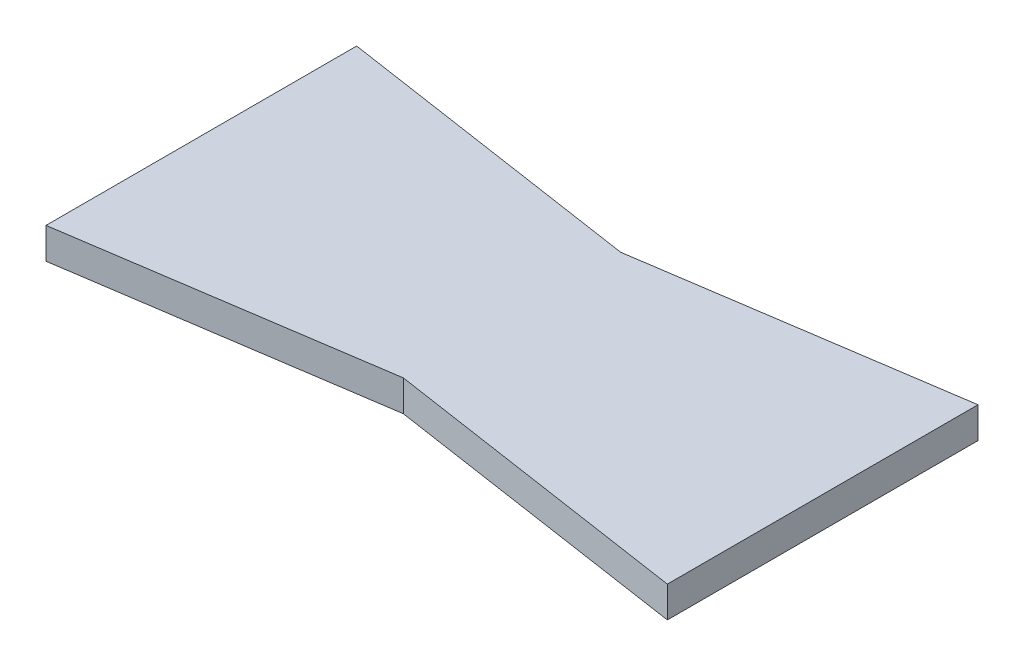
ISO-10303-21;
HEADER;
FILE_DESCRIPTION(('STEP AP214'),'2;1');
FILE_NAME('part.step','',(''),(''),'','','');
FILE_SCHEMA(('AUTOMOTIVE_DESIGN { 1 0 10303 214 1 1 1 1 }'));
ENDSEC;
DATA;
#1=APPLICATION_CONTEXT('core data for automotive mechanical design processes');
#2=APPLICATION_PROTOCOL_DEFINITION('international standard','automotive_design',2000,#1);
#3=PRODUCT_CONTEXT('',#1,'mechanical');
#4=PRODUCT('Part','Part','',(#3));
#5=PRODUCT_RELATED_PRODUCT_CATEGORY('part','',(#4));
#6=PRODUCT_DEFINITION_FORMATION('','',#4);
#7=PRODUCT_DEFINITION_CONTEXT('part definition',#1,'design');
#8=PRODUCT_DEFINITION('design','',#6,#7);
#9=PRODUCT_DEFINITION_SHAPE('','',#8);
#10=(LENGTH_UNIT() NAMED_UNIT(*) SI_UNIT(.MILLI.,.METRE.));
#11=(NAMED_UNIT(*) PLANE_ANGLE_UNIT() SI_UNIT($,.RADIAN.));
#12=(NAMED_UNIT(*) SI_UNIT($,.STERADIAN.) SOLID_ANGLE_UNIT());
#13=UNCERTAINTY_MEASURE_WITH_UNIT(LENGTH_MEASURE(1.E-05),#10,'distance_accuracy_value','');
#14=(GEOMETRIC_REPRESENTATION_CONTEXT(3) GLOBAL_UNCERTAINTY_ASSIGNED_CONTEXT((#13)) GLOBAL_UNIT_ASSIGNED_CONTEXT((#10,
#11,#12)) REPRESENTATION_CONTEXT('',''));
#15=CARTESIAN_POINT('',(0.,0.,0.));
#16=DIRECTION('',(0.,0.,1.));
#17=DIRECTION('',(1.,0.,0.));
#18=AXIS2_PLACEMENT_3D('',#15,#16,#17);
#19=CARTESIAN_POINT('',(-33.992673992674,4.,-22.1245421245421));
#20=DIRECTION('',(1.,0.,0.));
#21=DIRECTION('',(0.,0.,-1.));
#22=AXIS2_PLACEMENT_3D('',#19,#20,#21);
#23=PLANE('',#22);
#24=DIRECTION('',(0.,0.,1.));
#25=VECTOR('',#24,1.);
#26=CARTESIAN_POINT('',(-33.992673992674,0.,-22.1245421245421));
#27=LINE('',#26,#25);
#28=CARTESIAN_POINT('',(-33.992673992674,0.,-22.1245421245421));
#29=VERTEX_POINT('',#28);
#30=CARTESIAN_POINT('',(-33.992673992674,0.,17.8754578754579));
#31=VERTEX_POINT('',#30);
#32=EDGE_CURVE('E117',#29,#31,#27,.T.);
#33=ORIENTED_EDGE('',*,*,#32,.T.);
#34=DIRECTION('',(0.,-1.,0.));
#35=VECTOR('',#34,1.);
#36=CARTESIAN_POINT('',(-33.992673992674,4.,17.8754578754579));
#37=LINE('',#36,#35);
#38=CARTESIAN_POINT('',(-33.992673992674,4.,17.8754578754579));
#39=VERTEX_POINT('',#38);
#40=EDGE_CURVE('E11',#39,#31,#37,.T.);
#41=ORIENTED_EDGE('',*,*,#40,.F.);
#42=DIRECTION('',(0.,0.,1.));
#43=VECTOR('',#42,1.);
#44=CARTESIAN_POINT('',(-33.992673992674,4.,-22.1245421245421));
#45=LINE('',#44,#43);
#46=CARTESIAN_POINT('',(-33.992673992674,4.,-22.1245421245421));
#47=VERTEX_POINT('',#46);
#48=EDGE_CURVE('E127',#47,#39,#45,.T.);
#49=ORIENTED_EDGE('',*,*,#48,.F.);
#50=DIRECTION('',(0.,-1.,0.));
#51=VECTOR('',#50,1.);
#52=CARTESIAN_POINT('',(-33.992673992674,4.,-22.1245421245421));
#53=LINE('',#52,#51);
#54=EDGE_CURVE('E113',#47,#29,#53,.T.);
#55=ORIENTED_EDGE('',*,*,#54,.T.);
#56=EDGE_LOOP('',(#33,#41,#49,#55));
#57=FACE_BOUND('',#56,.T.);
#58=ADVANCED_FACE('F33',(#57),#23,.F.);
#59=CARTESIAN_POINT('',(-33.992673992674,4.,17.8754578754579));
#60=DIRECTION('',(-0.148340452930245,0.,-0.988936352868298));
#61=DIRECTION('',(-0.988936352868298,0.,0.148340452930245));
#62=AXIS2_PLACEMENT_3D('',#59,#60,#61);
#63=PLANE('',#62);
#64=DIRECTION('',(0.988936352868298,0.,-0.148340452930245));
#65=VECTOR('',#64,1.);
#66=CARTESIAN_POINT('',(-33.992673992674,0.,17.8754578754579));
#67=LINE('',#66,#65);
#68=CARTESIAN_POINT('',(6.00732600732602,0.,11.8754578754579));
#69=VERTEX_POINT('',#68);
#70=EDGE_CURVE('E120',#31,#69,#67,.T.);
#71=ORIENTED_EDGE('',*,*,#70,.T.);
#72=DIRECTION('',(0.,-1.,0.));
#73=VECTOR('',#72,1.);
#74=CARTESIAN_POINT('',(6.00732600732602,4.,11.8754578754579));
#75=LINE('',#74,#73);
#76=CARTESIAN_POINT('',(6.00732600732602,4.,11.8754578754579));
#77=VERTEX_POINT('',#76);
#78=EDGE_CURVE('E41',#77,#69,#75,.T.);
#79=ORIENTED_EDGE('',*,*,#78,.F.);
#80=DIRECTION('',(0.988936352868298,0.,-0.148340452930245));
#81=VECTOR('',#80,1.);
#82=CARTESIAN_POINT('',(-33.992673992674,4.,17.8754578754579));
#83=LINE('',#82,#81);
#84=EDGE_CURVE('E86',#39,#77,#83,.T.);
#85=ORIENTED_EDGE('',*,*,#84,.F.);
#86=ORIENTED_EDGE('',*,*,#40,.T.);
#87=EDGE_LOOP('',(#71,#79,#85,#86));
#88=FACE_BOUND('',#87,.T.);
#89=ADVANCED_FACE('F151',(#88),#63,.F.);
#90=CARTESIAN_POINT('',(6.00732600732602,4.,11.8754578754579));
#91=DIRECTION('',(0.148340452930245,0.,-0.988936352868298));
#92=DIRECTION('',(-0.988936352868298,0.,-0.148340452930245));
#93=AXIS2_PLACEMENT_3D('',#90,#91,#92);
#94=PLANE('',#93);
#95=DIRECTION('',(0.988936352868298,0.,0.148340452930245));
#96=VECTOR('',#95,1.);
#97=CARTESIAN_POINT('',(6.00732600732602,0.,11.8754578754579));
#98=LINE('',#97,#96);
#99=CARTESIAN_POINT('',(46.007326007326,0.,17.8754578754579));
#100=VERTEX_POINT('',#99);
#101=EDGE_CURVE('E122',#69,#100,#98,.T.);
#102=ORIENTED_EDGE('',*,*,#101,.T.);
#103=DIRECTION('',(0.,-1.,0.));
#104=VECTOR('',#103,1.);
#105=CARTESIAN_POINT('',(46.007326007326,4.,17.8754578754579));
#106=LINE('',#105,#104);
#107=CARTESIAN_POINT('',(46.007326007326,4.,17.8754578754579));
#108=VERTEX_POINT('',#107);
#109=EDGE_CURVE('E108',#108,#100,#106,.T.);
#110=ORIENTED_EDGE('',*,*,#109,.F.);
#111=DIRECTION('',(0.988936352868298,0.,0.148340452930245));
#112=VECTOR('',#111,1.);
#113=CARTESIAN_POINT('',(6.00732600732602,4.,11.8754578754579));
#114=LINE('',#113,#112);
#115=EDGE_CURVE('E99',#77,#108,#114,.T.);
#116=ORIENTED_EDGE('',*,*,#115,.F.);
#117=ORIENTED_EDGE('',*,*,#78,.T.);
#118=EDGE_LOOP('',(#102,#110,#116,#117));
#119=FACE_BOUND('',#118,.T.);
#120=ADVANCED_FACE('F133',(#119),#94,.F.);
#121=CARTESIAN_POINT('',(46.007326007326,4.,-22.1245421245421));
#122=DIRECTION('',(-1.,0.,0.));
#123=DIRECTION('',(0.,0.,1.));
#124=AXIS2_PLACEMENT_3D('',#121,#122,#123);
#125=PLANE('',#124);
#126=DIRECTION('',(0.,0.,-1.));
#127=VECTOR('',#126,1.);
#128=CARTESIAN_POINT('',(46.007326007326,0.,-22.1245421245421));
#129=LINE('',#128,#127);
#130=CARTESIAN_POINT('',(46.007326007326,0.,-22.1245421245421));
#131=VERTEX_POINT('',#130);
#132=EDGE_CURVE('E107',#100,#131,#129,.T.);
#133=ORIENTED_EDGE('',*,*,#132,.T.);
#134=DIRECTION('',(0.,-1.,0.));
#135=VECTOR('',#134,1.);
#136=CARTESIAN_POINT('',(46.007326007326,4.,-22.1245421245421));
#137=LINE('',#136,#135);
#138=CARTESIAN_POINT('',(46.007326007326,4.,-22.1245421245421));
#139=VERTEX_POINT('',#138);
#140=EDGE_CURVE('E104',#139,#131,#137,.T.);
#141=ORIENTED_EDGE('',*,*,#140,.F.);
#142=DIRECTION('',(0.,0.,-1.));
#143=VECTOR('',#142,1.);
#144=CARTESIAN_POINT('',(46.007326007326,4.,-22.1245421245421));
#145=LINE('',#144,#143);
#146=EDGE_CURVE('E93',#108,#139,#145,.T.);
#147=ORIENTED_EDGE('',*,*,#146,.F.);
#148=ORIENTED_EDGE('',*,*,#109,.T.);
#149=EDGE_LOOP('',(#133,#141,#147,#148));
#150=FACE_BOUND('',#149,.T.);
#151=ADVANCED_FACE('F105',(#150),#125,.F.);
#152=CARTESIAN_POINT('',(6.00732600732602,4.,-16.1245421245421));
#153=DIRECTION('',(0.148340452930245,0.,0.988936352868298));
#154=DIRECTION('',(0.988936352868298,0.,-0.148340452930245));
#155=AXIS2_PLACEMENT_3D('',#152,#153,#154);
#156=PLANE('',#155);
#157=DIRECTION('',(-0.988936352868298,0.,0.148340452930245));
#158=VECTOR('',#157,1.);
#159=CARTESIAN_POINT('',(6.00732600732602,0.,-16.1245421245421));
#160=LINE('',#159,#158);
#161=CARTESIAN_POINT('',(6.00732600732602,0.,-16.1245421245421));
#162=VERTEX_POINT('',#161);
#163=EDGE_CURVE('E72',#131,#162,#160,.T.);
#164=ORIENTED_EDGE('',*,*,#163,.T.);
#165=DIRECTION('',(0.,-1.,0.));
#166=VECTOR('',#165,1.);
#167=CARTESIAN_POINT('',(6.00732600732602,4.,-16.1245421245421));
#168=LINE('',#167,#166);
#169=CARTESIAN_POINT('',(6.00732600732602,4.,-16.1245421245421));
#170=VERTEX_POINT('',#169);
#171=EDGE_CURVE('E109',#170,#162,#168,.T.);
#172=ORIENTED_EDGE('',*,*,#171,.F.);
#173=DIRECTION('',(-0.988936352868298,0.,0.148340452930245));
#174=VECTOR('',#173,1.);
#175=CARTESIAN_POINT('',(6.00732600732602,4.,-16.1245421245421));
#176=LINE('',#175,#174);
#177=EDGE_CURVE('E97',#139,#170,#176,.T.);
#178=ORIENTED_EDGE('',*,*,#177,.F.);
#179=ORIENTED_EDGE('',*,*,#140,.T.);
#180=EDGE_LOOP('',(#164,#172,#178,#179));
#181=FACE_BOUND('',#180,.T.);
#182=ADVANCED_FACE('F111',(#181),#156,.F.);
#183=CARTESIAN_POINT('',(-33.992673992674,4.,-22.1245421245421));
#184=DIRECTION('',(-0.148340452930245,0.,0.988936352868298));
#185=DIRECTION('',(0.988936352868298,0.,0.148340452930245));
#186=AXIS2_PLACEMENT_3D('',#183,#184,#185);
#187=PLANE('',#186);
#188=DIRECTION('',(-0.988936352868298,0.,-0.148340452930245));
#189=VECTOR('',#188,1.);
#190=CARTESIAN_POINT('',(-33.992673992674,0.,-22.1245421245421));
#191=LINE('',#190,#189);
#192=EDGE_CURVE('E78',#162,#29,#191,.T.);
#193=ORIENTED_EDGE('',*,*,#192,.T.);
#194=ORIENTED_EDGE('',*,*,#54,.F.);
#195=DIRECTION('',(-0.988936352868298,0.,-0.148340452930245));
#196=VECTOR('',#195,1.);
#197=CARTESIAN_POINT('',(-33.992673992674,4.,-22.1245421245421));
#198=LINE('',#197,#196);
#199=EDGE_CURVE('E49',#170,#47,#198,.T.);
#200=ORIENTED_EDGE('',*,*,#199,.F.);
#201=ORIENTED_EDGE('',*,*,#171,.T.);
#202=EDGE_LOOP('',(#193,#194,#200,#201));
#203=FACE_BOUND('',#202,.T.);
#204=ADVANCED_FACE('F140',(#203),#187,.F.);
#205=CARTESIAN_POINT('',(0.,4.,0.));
#206=DIRECTION('',(0.,1.,0.));
#207=DIRECTION('',(0.,0.,1.));
#208=AXIS2_PLACEMENT_3D('',#205,#206,#207);
#209=PLANE('',#208);
#210=ORIENTED_EDGE('',*,*,#48,.T.);
#211=ORIENTED_EDGE('',*,*,#84,.T.);
#212=ORIENTED_EDGE('',*,*,#115,.T.);
#213=ORIENTED_EDGE('',*,*,#146,.T.);
#214=ORIENTED_EDGE('',*,*,#177,.T.);
#215=ORIENTED_EDGE('',*,*,#199,.T.);
#216=EDGE_LOOP('',(#210,#211,#212,#213,#214,#215));
#217=FACE_BOUND('',#216,.T.);
#218=ADVANCED_FACE('F95',(#217),#209,.T.);
#219=CARTESIAN_POINT('',(0.,0.,0.));
#220=DIRECTION('',(0.,1.,0.));
#221=DIRECTION('',(0.,0.,1.));
#222=AXIS2_PLACEMENT_3D('',#219,#220,#221);
#223=PLANE('',#222);
#224=ORIENTED_EDGE('',*,*,#32,.F.);
#225=ORIENTED_EDGE('',*,*,#192,.F.);
#226=ORIENTED_EDGE('',*,*,#163,.F.);
#227=ORIENTED_EDGE('',*,*,#132,.F.);
#228=ORIENTED_EDGE('',*,*,#101,.F.);
#229=ORIENTED_EDGE('',*,*,#70,.F.);
#230=EDGE_LOOP('',(#224,#225,#226,#227,#228,#229));
#231=FACE_BOUND('',#230,.T.);
#232=ADVANCED_FACE('F136',(#231),#223,.F.);
#233=CLOSED_SHELL('',(#58,#89,#120,#151,#182,#204,#218,#232));
#234=MANIFOLD_SOLID_BREP('B2',#233);
#235=ADVANCED_BREP_SHAPE_REPRESENTATION('',(#18,#234),#14);
#236=SHAPE_DEFINITION_REPRESENTATION(#9,#235);
ENDSEC;
END-ISO-10303-21;
